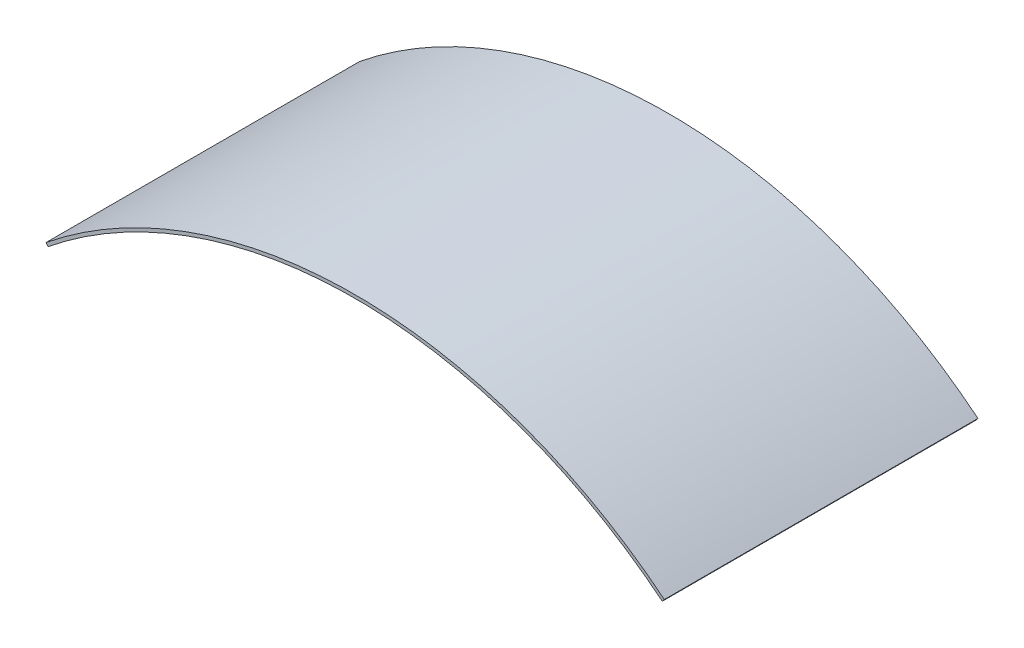
ISO-10303-21;
HEADER;
FILE_DESCRIPTION(('STEP AP214'),'2;1');
FILE_NAME('part.step','',(''),(''),'','','');
FILE_SCHEMA(('AUTOMOTIVE_DESIGN { 1 0 10303 214 1 1 1 1 }'));
ENDSEC;
DATA;
#1=APPLICATION_CONTEXT('core data for automotive mechanical design processes');
#2=APPLICATION_PROTOCOL_DEFINITION('international standard','automotive_design',2000,#1);
#3=PRODUCT_CONTEXT('',#1,'mechanical');
#4=PRODUCT('Part','Part','',(#3));
#5=PRODUCT_RELATED_PRODUCT_CATEGORY('part','',(#4));
#6=PRODUCT_DEFINITION_FORMATION('','',#4);
#7=PRODUCT_DEFINITION_CONTEXT('part definition',#1,'design');
#8=PRODUCT_DEFINITION('design','',#6,#7);
#9=PRODUCT_DEFINITION_SHAPE('','',#8);
#10=(LENGTH_UNIT() NAMED_UNIT(*) SI_UNIT(.MILLI.,.METRE.));
#11=(NAMED_UNIT(*) PLANE_ANGLE_UNIT() SI_UNIT($,.RADIAN.));
#12=(NAMED_UNIT(*) SI_UNIT($,.STERADIAN.) SOLID_ANGLE_UNIT());
#13=UNCERTAINTY_MEASURE_WITH_UNIT(LENGTH_MEASURE(1.E-05),#10,'distance_accuracy_value','');
#14=(GEOMETRIC_REPRESENTATION_CONTEXT(3) GLOBAL_UNCERTAINTY_ASSIGNED_CONTEXT((#13)) GLOBAL_UNIT_ASSIGNED_CONTEXT((#10,
#11,#12)) REPRESENTATION_CONTEXT('',''));
#15=CARTESIAN_POINT('',(0.,0.,0.));
#16=DIRECTION('',(0.,0.,1.));
#17=DIRECTION('',(1.,0.,0.));
#18=AXIS2_PLACEMENT_3D('',#15,#16,#17);
#19=CARTESIAN_POINT('',(0.,-368.913601952704,152.4));
#20=DIRECTION('',(0.,0.,-1.));
#21=DIRECTION('',(-1.,0.,0.));
#22=AXIS2_PLACEMENT_3D('',#19,#20,#21);
#23=CYLINDRICAL_SURFACE('',#22,474.520440240163);
#24=CARTESIAN_POINT('',(0.,-368.913601952704,-152.4));
#25=DIRECTION('',(0.,0.,-1.));
#26=DIRECTION('',(-1.,0.,0.));
#27=AXIS2_PLACEMENT_3D('',#24,#25,#26);
#28=CIRCLE('',#27,474.520440240163);
#29=CARTESIAN_POINT('',(-298.45,0.,-152.4));
#30=VERTEX_POINT('',#29);
#31=CARTESIAN_POINT('',(298.45,-9.54097911787244E-13,-152.4));
#32=VERTEX_POINT('',#31);
#33=EDGE_CURVE('E102',#30,#32,#28,.T.);
#34=ORIENTED_EDGE('',*,*,#33,.T.);
#35=DIRECTION('',(0.,0.,-1.));
#36=VECTOR('',#35,1.);
#37=CARTESIAN_POINT('',(298.45,-9.54097911787244E-13,152.4));
#38=LINE('',#37,#36);
#39=CARTESIAN_POINT('',(298.45,-9.54097911787244E-13,152.4));
#40=VERTEX_POINT('',#39);
#41=EDGE_CURVE('E11',#40,#32,#38,.T.);
#42=ORIENTED_EDGE('',*,*,#41,.F.);
#43=CARTESIAN_POINT('',(0.,-368.913601952704,152.4));
#44=DIRECTION('',(0.,0.,-1.));
#45=DIRECTION('',(-1.,0.,0.));
#46=AXIS2_PLACEMENT_3D('',#43,#44,#45);
#47=CIRCLE('',#46,474.520440240163);
#48=CARTESIAN_POINT('',(-298.45,0.,152.4));
#49=VERTEX_POINT('',#48);
#50=EDGE_CURVE('E90',#49,#40,#47,.T.);
#51=ORIENTED_EDGE('',*,*,#50,.F.);
#52=DIRECTION('',(0.,0.,-1.));
#53=VECTOR('',#52,1.);
#54=CARTESIAN_POINT('',(-298.45,0.,152.4));
#55=LINE('',#54,#53);
#56=EDGE_CURVE('E98',#49,#30,#55,.T.);
#57=ORIENTED_EDGE('',*,*,#56,.T.);
#58=EDGE_LOOP('',(#34,#42,#51,#57));
#59=FACE_BOUND('',#58,.T.);
#60=ADVANCED_FACE('F39',(#59),#23,.F.);
#61=CARTESIAN_POINT('',(298.45,-9.54097911787244E-13,152.4));
#62=DIRECTION('',(-0.777445122840204,0.628950777861019,0.));
#63=DIRECTION('',(-0.628950777861019,-0.777445122840204,0.));
#64=AXIS2_PLACEMENT_3D('',#61,#62,#63);
#65=PLANE('',#64);
#66=DIRECTION('',(0.628950777861019,0.777445122840204,0.));
#67=VECTOR('',#66,1.);
#68=CARTESIAN_POINT('',(298.45,-9.54097911787244E-13,-152.4));
#69=LINE('',#68,#67);
#70=CARTESIAN_POINT('',(300.446918719709,2.46838826501672,-152.4));
#71=VERTEX_POINT('',#70);
#72=EDGE_CURVE('E94',#32,#71,#69,.T.);
#73=ORIENTED_EDGE('',*,*,#72,.T.);
#74=DIRECTION('',(0.,0.,-1.));
#75=VECTOR('',#74,1.);
#76=CARTESIAN_POINT('',(300.446918719709,2.46838826501672,152.4));
#77=LINE('',#76,#75);
#78=CARTESIAN_POINT('',(300.446918719709,2.46838826501672,152.4));
#79=VERTEX_POINT('',#78);
#80=EDGE_CURVE('E47',#79,#71,#77,.T.);
#81=ORIENTED_EDGE('',*,*,#80,.F.);
#82=DIRECTION('',(0.628950777861019,0.777445122840204,0.));
#83=VECTOR('',#82,1.);
#84=CARTESIAN_POINT('',(298.45,-9.54097911787244E-13,152.4));
#85=LINE('',#84,#83);
#86=EDGE_CURVE('E85',#40,#79,#85,.T.);
#87=ORIENTED_EDGE('',*,*,#86,.F.);
#88=ORIENTED_EDGE('',*,*,#41,.T.);
#89=EDGE_LOOP('',(#73,#81,#87,#88));
#90=FACE_BOUND('',#89,.T.);
#91=ADVANCED_FACE('F93',(#90),#65,.F.);
#92=CARTESIAN_POINT('',(0.,-368.913601952704,152.4));
#93=DIRECTION('',(0.,0.,-1.));
#94=DIRECTION('',(-1.,0.,0.));
#95=AXIS2_PLACEMENT_3D('',#92,#93,#94);
#96=CYLINDRICAL_SURFACE('',#95,477.695440240163);
#97=CARTESIAN_POINT('',(0.,-368.913601952704,-152.4));
#98=DIRECTION('',(0.,0.,1.));
#99=DIRECTION('',(-1.,0.,0.));
#100=AXIS2_PLACEMENT_3D('',#97,#98,#99);
#101=CIRCLE('',#100,477.695440240163);
#102=CARTESIAN_POINT('',(-300.446918719709,2.46838826501671,-152.4));
#103=VERTEX_POINT('',#102);
#104=EDGE_CURVE('E72',#71,#103,#101,.T.);
#105=ORIENTED_EDGE('',*,*,#104,.T.);
#106=DIRECTION('',(0.,0.,-1.));
#107=VECTOR('',#106,1.);
#108=CARTESIAN_POINT('',(-300.446918719709,2.46838826501671,152.4));
#109=LINE('',#108,#107);
#110=CARTESIAN_POINT('',(-300.446918719709,2.46838826501671,152.4));
#111=VERTEX_POINT('',#110);
#112=EDGE_CURVE('E95',#111,#103,#109,.T.);
#113=ORIENTED_EDGE('',*,*,#112,.F.);
#114=CARTESIAN_POINT('',(0.,-368.913601952704,152.4));
#115=DIRECTION('',(0.,0.,1.));
#116=DIRECTION('',(-1.,0.,0.));
#117=AXIS2_PLACEMENT_3D('',#114,#115,#116);
#118=CIRCLE('',#117,477.695440240163);
#119=EDGE_CURVE('E88',#79,#111,#118,.T.);
#120=ORIENTED_EDGE('',*,*,#119,.F.);
#121=ORIENTED_EDGE('',*,*,#80,.T.);
#122=EDGE_LOOP('',(#105,#113,#120,#121));
#123=FACE_BOUND('',#122,.T.);
#124=ADVANCED_FACE('F96',(#123),#96,.T.);
#125=CARTESIAN_POINT('',(-298.45,0.,152.4));
#126=DIRECTION('',(0.777445122840093,0.628950777861155,0.));
#127=DIRECTION('',(-0.628950777861155,0.777445122840094,0.));
#128=AXIS2_PLACEMENT_3D('',#125,#126,#127);
#129=PLANE('',#128);
#130=DIRECTION('',(0.628950777861155,-0.777445122840093,0.));
#131=VECTOR('',#130,1.);
#132=CARTESIAN_POINT('',(-298.45,0.,-152.4));
#133=LINE('',#132,#131);
#134=EDGE_CURVE('E78',#103,#30,#133,.T.);
#135=ORIENTED_EDGE('',*,*,#134,.T.);
#136=ORIENTED_EDGE('',*,*,#56,.F.);
#137=DIRECTION('',(0.628950777861155,-0.777445122840093,0.));
#138=VECTOR('',#137,1.);
#139=CARTESIAN_POINT('',(-298.45,0.,152.4));
#140=LINE('',#139,#138);
#141=EDGE_CURVE('E55',#111,#49,#140,.T.);
#142=ORIENTED_EDGE('',*,*,#141,.F.);
#143=ORIENTED_EDGE('',*,*,#112,.T.);
#144=EDGE_LOOP('',(#135,#136,#142,#143));
#145=FACE_BOUND('',#144,.T.);
#146=ADVANCED_FACE('F109',(#145),#129,.F.);
#147=CARTESIAN_POINT('',(0.,-368.913601952704,152.4));
#148=DIRECTION('',(0.,0.,-1.));
#149=DIRECTION('',(-1.,0.,0.));
#150=AXIS2_PLACEMENT_3D('',#147,#148,#149);
#151=PLANE('',#150);
#152=ORIENTED_EDGE('',*,*,#50,.T.);
#153=ORIENTED_EDGE('',*,*,#86,.T.);
#154=ORIENTED_EDGE('',*,*,#119,.T.);
#155=ORIENTED_EDGE('',*,*,#141,.T.);
#156=EDGE_LOOP('',(#152,#153,#154,#155));
#157=FACE_BOUND('',#156,.T.);
#158=ADVANCED_FACE('F86',(#157),#151,.F.);
#159=CARTESIAN_POINT('',(0.,-368.913601952704,-152.4));
#160=DIRECTION('',(0.,0.,-1.));
#161=DIRECTION('',(-1.,0.,0.));
#162=AXIS2_PLACEMENT_3D('',#159,#160,#161);
#163=PLANE('',#162);
#164=ORIENTED_EDGE('',*,*,#33,.F.);
#165=ORIENTED_EDGE('',*,*,#134,.F.);
#166=ORIENTED_EDGE('',*,*,#104,.F.);
#167=ORIENTED_EDGE('',*,*,#72,.F.);
#168=EDGE_LOOP('',(#164,#165,#166,#167));
#169=FACE_BOUND('',#168,.T.);
#170=ADVANCED_FACE('F112',(#169),#163,.T.);
#171=CLOSED_SHELL('',(#60,#91,#124,#146,#158,#170));
#172=MANIFOLD_SOLID_BREP('B2',#171);
#173=ADVANCED_BREP_SHAPE_REPRESENTATION('',(#18,#172),#14);
#174=SHAPE_DEFINITION_REPRESENTATION(#9,#173);
ENDSEC;
END-ISO-10303-21;
